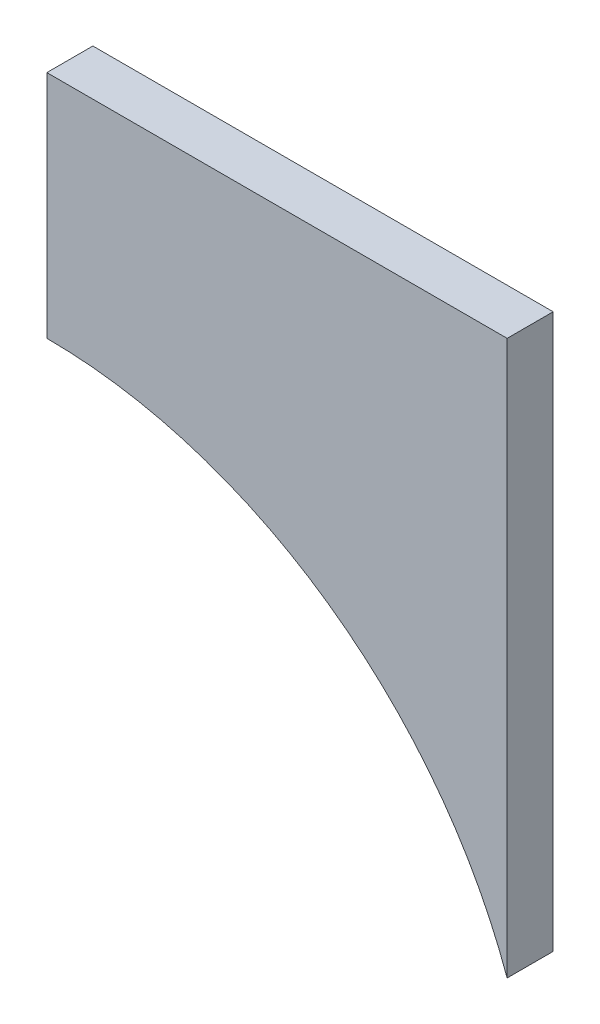
ISO-10303-21;
HEADER;
FILE_DESCRIPTION(('STEP AP214'),'2;1');
FILE_NAME('part.step','',(''),(''),'','','');
FILE_SCHEMA(('AUTOMOTIVE_DESIGN { 1 0 10303 214 1 1 1 1 }'));
ENDSEC;
DATA;
#1=APPLICATION_CONTEXT('core data for automotive mechanical design processes');
#2=APPLICATION_PROTOCOL_DEFINITION('international standard','automotive_design',2000,#1);
#3=PRODUCT_CONTEXT('',#1,'mechanical');
#4=PRODUCT('Part','Part','',(#3));
#5=PRODUCT_RELATED_PRODUCT_CATEGORY('part','',(#4));
#6=PRODUCT_DEFINITION_FORMATION('','',#4);
#7=PRODUCT_DEFINITION_CONTEXT('part definition',#1,'design');
#8=PRODUCT_DEFINITION('design','',#6,#7);
#9=PRODUCT_DEFINITION_SHAPE('','',#8);
#10=(LENGTH_UNIT() NAMED_UNIT(*) SI_UNIT(.MILLI.,.METRE.));
#11=(NAMED_UNIT(*) PLANE_ANGLE_UNIT() SI_UNIT($,.RADIAN.));
#12=(NAMED_UNIT(*) SI_UNIT($,.STERADIAN.) SOLID_ANGLE_UNIT());
#13=UNCERTAINTY_MEASURE_WITH_UNIT(LENGTH_MEASURE(1.E-05),#10,'distance_accuracy_value','');
#14=(GEOMETRIC_REPRESENTATION_CONTEXT(3) GLOBAL_UNCERTAINTY_ASSIGNED_CONTEXT((#13)) GLOBAL_UNIT_ASSIGNED_CONTEXT((#10,
#11,#12)) REPRESENTATION_CONTEXT('',''));
#15=CARTESIAN_POINT('',(0.,0.,0.));
#16=DIRECTION('',(0.,0.,1.));
#17=DIRECTION('',(1.,0.,0.));
#18=AXIS2_PLACEMENT_3D('',#15,#16,#17);
#19=CARTESIAN_POINT('',(-0.2,-0.525,0.));
#20=DIRECTION('',(0.,0.,-1.));
#21=DIRECTION('',(-1.,0.,0.));
#22=AXIS2_PLACEMENT_3D('',#19,#20,#21);
#23=PLANE('',#22);
#24=DIRECTION('',(1.,0.,0.));
#25=VECTOR('',#24,1.);
#26=CARTESIAN_POINT('',(0.2,0.1,0.));
#27=LINE('',#26,#25);
#28=CARTESIAN_POINT('',(-0.2,0.1,0.));
#29=VERTEX_POINT('',#28);
#30=CARTESIAN_POINT('',(0.2,0.1,0.));
#31=VERTEX_POINT('',#30);
#32=EDGE_CURVE('E60',#29,#31,#27,.T.);
#33=ORIENTED_EDGE('',*,*,#32,.T.);
#34=DIRECTION('',(0.,-1.,0.));
#35=VECTOR('',#34,1.);
#36=CARTESIAN_POINT('',(0.2,-0.381385933836549,0.));
#37=LINE('',#36,#35);
#38=CARTESIAN_POINT('',(0.2,-0.381385933836549,0.));
#39=VERTEX_POINT('',#38);
#40=EDGE_CURVE('E49',#31,#39,#37,.T.);
#41=ORIENTED_EDGE('',*,*,#40,.T.);
#42=CARTESIAN_POINT('',(-0.2,-0.525,0.));
#43=DIRECTION('',(0.,0.,1.));
#44=DIRECTION('',(1.,0.,0.));
#45=AXIS2_PLACEMENT_3D('',#42,#43,#44);
#46=CIRCLE('',#45,0.425);
#47=CARTESIAN_POINT('',(-0.2,-0.1,0.));
#48=VERTEX_POINT('',#47);
#49=EDGE_CURVE('E19',#39,#48,#46,.T.);
#50=ORIENTED_EDGE('',*,*,#49,.T.);
#51=DIRECTION('',(0.,1.,0.));
#52=VECTOR('',#51,1.);
#53=CARTESIAN_POINT('',(-0.2,0.1,0.));
#54=LINE('',#53,#52);
#55=EDGE_CURVE('E56',#48,#29,#54,.T.);
#56=ORIENTED_EDGE('',*,*,#55,.T.);
#57=EDGE_LOOP('',(#33,#41,#50,#56));
#58=FACE_BOUND('',#57,.T.);
#59=ADVANCED_FACE('F16',(#58),#23,.T.);
#60=CARTESIAN_POINT('',(-0.2,0.1,0.04));
#61=DIRECTION('',(1.,0.,0.));
#62=DIRECTION('',(0.,0.,-1.));
#63=AXIS2_PLACEMENT_3D('',#60,#61,#62);
#64=PLANE('',#63);
#65=DIRECTION('',(0.,0.,1.));
#66=VECTOR('',#65,1.);
#67=CARTESIAN_POINT('',(-0.2,-0.1,0.04));
#68=LINE('',#67,#66);
#69=CARTESIAN_POINT('',(-0.2,-0.1,0.04));
#70=VERTEX_POINT('',#69);
#71=EDGE_CURVE('E78',#48,#70,#68,.T.);
#72=ORIENTED_EDGE('',*,*,#71,.T.);
#73=DIRECTION('',(0.,1.,0.));
#74=VECTOR('',#73,1.);
#75=CARTESIAN_POINT('',(-0.2,-0.525,0.04));
#76=LINE('',#75,#74);
#77=CARTESIAN_POINT('',(-0.2,0.1,0.04));
#78=VERTEX_POINT('',#77);
#79=EDGE_CURVE('E74',#70,#78,#76,.T.);
#80=ORIENTED_EDGE('',*,*,#79,.T.);
#81=DIRECTION('',(0.,0.,1.));
#82=VECTOR('',#81,1.);
#83=CARTESIAN_POINT('',(-0.2,0.1,0.04));
#84=LINE('',#83,#82);
#85=EDGE_CURVE('E64',#78,#29,#84,.F.);
#86=ORIENTED_EDGE('',*,*,#85,.T.);
#87=ORIENTED_EDGE('',*,*,#55,.F.);
#88=EDGE_LOOP('',(#72,#80,#86,#87));
#89=FACE_BOUND('',#88,.T.);
#90=ADVANCED_FACE('F77',(#89),#64,.F.);
#91=CARTESIAN_POINT('',(0.2,0.1,0.04));
#92=DIRECTION('',(0.,-1.,0.));
#93=DIRECTION('',(1.,0.,0.));
#94=AXIS2_PLACEMENT_3D('',#91,#92,#93);
#95=PLANE('',#94);
#96=ORIENTED_EDGE('',*,*,#85,.F.);
#97=DIRECTION('',(-1.,0.,0.));
#98=VECTOR('',#97,1.);
#99=CARTESIAN_POINT('',(-0.2,0.1,0.04));
#100=LINE('',#99,#98);
#101=CARTESIAN_POINT('',(0.2,0.1,0.04));
#102=VERTEX_POINT('',#101);
#103=EDGE_CURVE('E68',#78,#102,#100,.F.);
#104=ORIENTED_EDGE('',*,*,#103,.T.);
#105=DIRECTION('',(0.,0.,1.));
#106=VECTOR('',#105,1.);
#107=CARTESIAN_POINT('',(0.2,0.1,0.04));
#108=LINE('',#107,#106);
#109=EDGE_CURVE('E88',#102,#31,#108,.F.);
#110=ORIENTED_EDGE('',*,*,#109,.T.);
#111=ORIENTED_EDGE('',*,*,#32,.F.);
#112=EDGE_LOOP('',(#96,#104,#110,#111));
#113=FACE_BOUND('',#112,.T.);
#114=ADVANCED_FACE('F66',(#113),#95,.F.);
#115=CARTESIAN_POINT('',(0.2,-0.381385933836549,0.04));
#116=DIRECTION('',(-1.,0.,0.));
#117=DIRECTION('',(0.,-1.,0.));
#118=AXIS2_PLACEMENT_3D('',#115,#116,#117);
#119=PLANE('',#118);
#120=ORIENTED_EDGE('',*,*,#109,.F.);
#121=DIRECTION('',(0.,1.,0.));
#122=VECTOR('',#121,1.);
#123=CARTESIAN_POINT('',(0.2,-0.525,0.04));
#124=LINE('',#123,#122);
#125=CARTESIAN_POINT('',(0.2,-0.381385933836549,0.04));
#126=VERTEX_POINT('',#125);
#127=EDGE_CURVE('E25',#102,#126,#124,.F.);
#128=ORIENTED_EDGE('',*,*,#127,.T.);
#129=DIRECTION('',(0.,0.,1.));
#130=VECTOR('',#129,1.);
#131=CARTESIAN_POINT('',(0.2,-0.381385933836549,0.04));
#132=LINE('',#131,#130);
#133=EDGE_CURVE('E32',#126,#39,#132,.F.);
#134=ORIENTED_EDGE('',*,*,#133,.T.);
#135=ORIENTED_EDGE('',*,*,#40,.F.);
#136=EDGE_LOOP('',(#120,#128,#134,#135));
#137=FACE_BOUND('',#136,.T.);
#138=ADVANCED_FACE('F106',(#137),#119,.F.);
#139=CARTESIAN_POINT('',(-0.2,-0.525,0.04));
#140=DIRECTION('',(0.,0.,1.));
#141=DIRECTION('',(1.,0.,0.));
#142=AXIS2_PLACEMENT_3D('',#139,#140,#141);
#143=CYLINDRICAL_SURFACE('',#142,0.425);
#144=ORIENTED_EDGE('',*,*,#133,.F.);
#145=CARTESIAN_POINT('',(-0.2,-0.525,0.04));
#146=DIRECTION('',(0.,0.,1.));
#147=DIRECTION('',(1.,0.,0.));
#148=AXIS2_PLACEMENT_3D('',#145,#146,#147);
#149=CIRCLE('',#148,0.425);
#150=EDGE_CURVE('E11',#126,#70,#149,.T.);
#151=ORIENTED_EDGE('',*,*,#150,.T.);
#152=ORIENTED_EDGE('',*,*,#71,.F.);
#153=ORIENTED_EDGE('',*,*,#49,.F.);
#154=EDGE_LOOP('',(#144,#151,#152,#153));
#155=FACE_BOUND('',#154,.T.);
#156=ADVANCED_FACE('F104',(#155),#143,.F.);
#157=CARTESIAN_POINT('',(-0.2,-0.525,0.04));
#158=DIRECTION('',(0.,0.,-1.));
#159=DIRECTION('',(-1.,0.,0.));
#160=AXIS2_PLACEMENT_3D('',#157,#158,#159);
#161=PLANE('',#160);
#162=ORIENTED_EDGE('',*,*,#127,.F.);
#163=ORIENTED_EDGE('',*,*,#103,.F.);
#164=ORIENTED_EDGE('',*,*,#79,.F.);
#165=ORIENTED_EDGE('',*,*,#150,.F.);
#166=EDGE_LOOP('',(#162,#163,#164,#165));
#167=FACE_BOUND('',#166,.T.);
#168=ADVANCED_FACE('F73',(#167),#161,.F.);
#169=CLOSED_SHELL('',(#59,#90,#114,#138,#156,#168));
#170=MANIFOLD_SOLID_BREP('B1',#169);
#171=ADVANCED_BREP_SHAPE_REPRESENTATION('',(#18,#170),#14);
#172=SHAPE_DEFINITION_REPRESENTATION(#9,#171);
ENDSEC;
END-ISO-10303-21;
